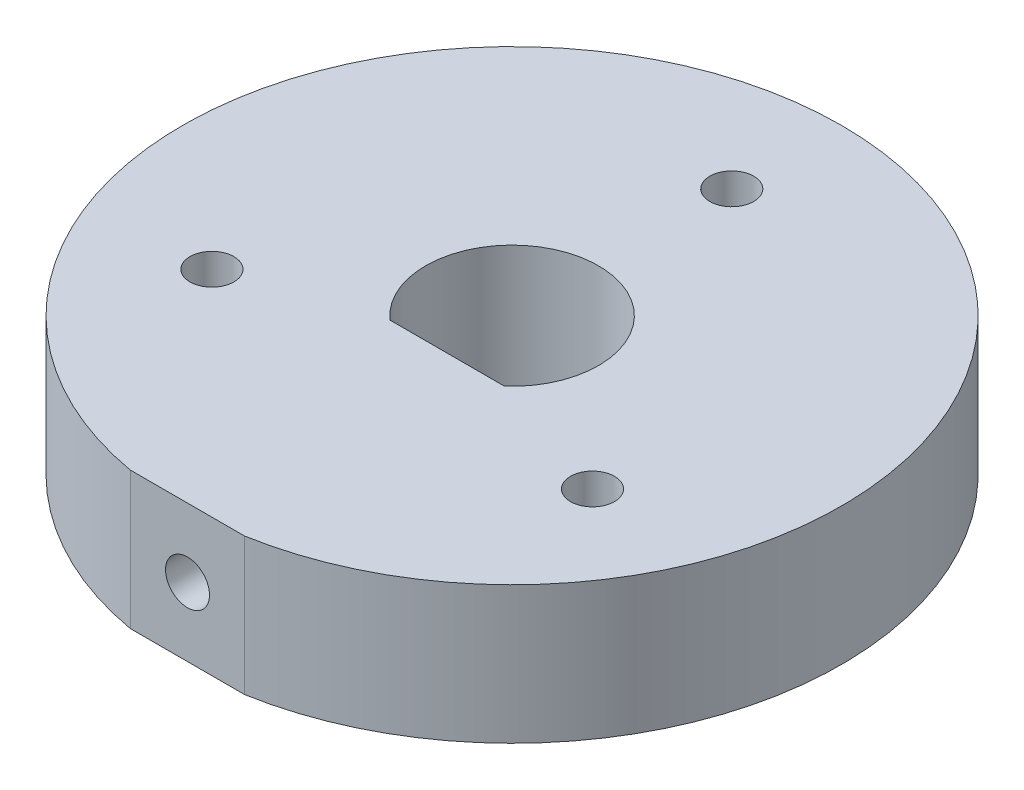
ISO-10303-21;
HEADER;
FILE_DESCRIPTION(('STEP AP214'),'2;1');
FILE_NAME('part.step','',(''),(''),'','','');
FILE_SCHEMA(('AUTOMOTIVE_DESIGN { 1 0 10303 214 1 1 1 1 }'));
ENDSEC;
DATA;
#1=APPLICATION_CONTEXT('core data for automotive mechanical design processes');
#2=APPLICATION_PROTOCOL_DEFINITION('international standard','automotive_design',2000,#1);
#3=PRODUCT_CONTEXT('',#1,'mechanical');
#4=PRODUCT('Part','Part','',(#3));
#5=PRODUCT_RELATED_PRODUCT_CATEGORY('part','',(#4));
#6=PRODUCT_DEFINITION_FORMATION('','',#4);
#7=PRODUCT_DEFINITION_CONTEXT('part definition',#1,'design');
#8=PRODUCT_DEFINITION('design','',#6,#7);
#9=PRODUCT_DEFINITION_SHAPE('','',#8);
#10=(LENGTH_UNIT() NAMED_UNIT(*) SI_UNIT(.MILLI.,.METRE.));
#11=(NAMED_UNIT(*) PLANE_ANGLE_UNIT() SI_UNIT($,.RADIAN.));
#12=(NAMED_UNIT(*) SI_UNIT($,.STERADIAN.) SOLID_ANGLE_UNIT());
#13=UNCERTAINTY_MEASURE_WITH_UNIT(LENGTH_MEASURE(1.E-05),#10,'distance_accuracy_value','');
#14=(GEOMETRIC_REPRESENTATION_CONTEXT(3) GLOBAL_UNCERTAINTY_ASSIGNED_CONTEXT((#13)) GLOBAL_UNIT_ASSIGNED_CONTEXT((#10,
#11,#12)) REPRESENTATION_CONTEXT('',''));
#15=CARTESIAN_POINT('',(0.,0.,0.));
#16=DIRECTION('',(0.,0.,1.));
#17=DIRECTION('',(1.,0.,0.));
#18=AXIS2_PLACEMENT_3D('',#15,#16,#17);
#19=CARTESIAN_POINT('',(0.,6.35,0.));
#20=DIRECTION('',(0.,-1.,0.));
#21=DIRECTION('',(0.,0.,-1.));
#22=AXIS2_PLACEMENT_3D('',#19,#20,#21);
#23=PLANE('',#22);
#24=CARTESIAN_POINT('',(8.79881810244988,6.35,5.08000000000004));
#25=DIRECTION('',(0.,1.,0.));
#26=DIRECTION('',(0.,0.,1.));
#27=AXIS2_PLACEMENT_3D('',#24,#25,#26);
#28=CIRCLE('',#27,1.016);
#29=CARTESIAN_POINT('',(8.79881810244988,6.35,6.09600000000004));
#30=VERTEX_POINT('',#29);
#31=EDGE_CURVE('E128',#30,#30,#28,.T.);
#32=ORIENTED_EDGE('',*,*,#31,.F.);
#33=EDGE_LOOP('',(#32));
#34=FACE_BOUND('',#33,.T.);
#35=CARTESIAN_POINT('',(0.,6.35,0.));
#36=DIRECTION('',(0.,1.,0.));
#37=DIRECTION('',(0.,0.,-1.));
#38=AXIS2_PLACEMENT_3D('',#35,#36,#37);
#39=CIRCLE('',#38,4.);
#40=CARTESIAN_POINT('',(2.64575131106459,6.35,3.));
#41=VERTEX_POINT('',#40);
#42=CARTESIAN_POINT('',(-2.64575131106459,6.35,3.));
#43=VERTEX_POINT('',#42);
#44=EDGE_CURVE('E78',#41,#43,#39,.T.);
#45=ORIENTED_EDGE('',*,*,#44,.F.);
#46=DIRECTION('',(1.,0.,0.));
#47=VECTOR('',#46,1.);
#48=CARTESIAN_POINT('',(-2.64575131106459,6.35,3.));
#49=LINE('',#48,#47);
#50=EDGE_CURVE('E72',#43,#41,#49,.T.);
#51=ORIENTED_EDGE('',*,*,#50,.F.);
#52=EDGE_LOOP('',(#45,#51));
#53=FACE_BOUND('',#52,.T.);
#54=CARTESIAN_POINT('',(0.,6.35,0.));
#55=DIRECTION('',(0.,1.,0.));
#56=DIRECTION('',(0.,0.,-1.));
#57=AXIS2_PLACEMENT_3D('',#54,#55,#56);
#58=CIRCLE('',#57,15.24);
#59=CARTESIAN_POINT('',(2.64575131106459,6.35,15.0085842103777));
#60=VERTEX_POINT('',#59);
#61=CARTESIAN_POINT('',(-2.64575131106459,6.35,15.0085842103777));
#62=VERTEX_POINT('',#61);
#63=EDGE_CURVE('E94',#60,#62,#58,.T.);
#64=ORIENTED_EDGE('',*,*,#63,.T.);
#65=DIRECTION('',(1.,0.,0.));
#66=VECTOR('',#65,1.);
#67=CARTESIAN_POINT('',(-2.64575131106459,6.35,15.0085842103777));
#68=LINE('',#67,#66);
#69=EDGE_CURVE('E97',#62,#60,#68,.T.);
#70=ORIENTED_EDGE('',*,*,#69,.T.);
#71=EDGE_LOOP('',(#64,#70));
#72=FACE_BOUND('',#71,.T.);
#73=CARTESIAN_POINT('',(0.,6.35,-10.16));
#74=DIRECTION('',(0.,1.,0.));
#75=DIRECTION('',(0.,0.,1.));
#76=AXIS2_PLACEMENT_3D('',#73,#74,#75);
#77=CIRCLE('',#76,1.016);
#78=CARTESIAN_POINT('',(0.,6.35,-9.144));
#79=VERTEX_POINT('',#78);
#80=EDGE_CURVE('E90',#79,#79,#77,.T.);
#81=ORIENTED_EDGE('',*,*,#80,.F.);
#82=EDGE_LOOP('',(#81));
#83=FACE_BOUND('',#82,.T.);
#84=CARTESIAN_POINT('',(-8.79881810244994,6.35,5.07999999999992));
#85=DIRECTION('',(0.,1.,0.));
#86=DIRECTION('',(0.,0.,1.));
#87=AXIS2_PLACEMENT_3D('',#84,#85,#86);
#88=CIRCLE('',#87,1.016);
#89=CARTESIAN_POINT('',(-8.79881810244994,6.35,6.09599999999992));
#90=VERTEX_POINT('',#89);
#91=EDGE_CURVE('E122',#90,#90,#88,.T.);
#92=ORIENTED_EDGE('',*,*,#91,.F.);
#93=EDGE_LOOP('',(#92));
#94=FACE_BOUND('',#93,.T.);
#95=ADVANCED_FACE('F32',(#34,#53,#72,#83,#94),#23,.F.);
#96=CARTESIAN_POINT('',(0.,0.,0.));
#97=DIRECTION('',(0.,-1.,0.));
#98=DIRECTION('',(0.,0.,-1.));
#99=AXIS2_PLACEMENT_3D('',#96,#97,#98);
#100=PLANE('',#99);
#101=CARTESIAN_POINT('',(8.79881810244988,0.,5.08000000000004));
#102=DIRECTION('',(0.,1.,0.));
#103=DIRECTION('',(0.,0.,1.));
#104=AXIS2_PLACEMENT_3D('',#101,#102,#103);
#105=CIRCLE('',#104,1.016);
#106=CARTESIAN_POINT('',(8.79881810244988,0.,6.09600000000004));
#107=VERTEX_POINT('',#106);
#108=EDGE_CURVE('E124',#107,#107,#105,.T.);
#109=ORIENTED_EDGE('',*,*,#108,.T.);
#110=EDGE_LOOP('',(#109));
#111=FACE_BOUND('',#110,.T.);
#112=DIRECTION('',(1.,0.,0.));
#113=VECTOR('',#112,1.);
#114=CARTESIAN_POINT('',(-2.64575131106459,0.,3.));
#115=LINE('',#114,#113);
#116=CARTESIAN_POINT('',(-2.64575131106459,0.,3.));
#117=VERTEX_POINT('',#116);
#118=CARTESIAN_POINT('',(2.64575131106459,0.,3.));
#119=VERTEX_POINT('',#118);
#120=EDGE_CURVE('E83',#117,#119,#115,.T.);
#121=ORIENTED_EDGE('',*,*,#120,.T.);
#122=CARTESIAN_POINT('',(0.,0.,0.));
#123=DIRECTION('',(0.,1.,0.));
#124=DIRECTION('',(0.,0.,-1.));
#125=AXIS2_PLACEMENT_3D('',#122,#123,#124);
#126=CIRCLE('',#125,4.);
#127=EDGE_CURVE('E54',#119,#117,#126,.T.);
#128=ORIENTED_EDGE('',*,*,#127,.T.);
#129=EDGE_LOOP('',(#121,#128));
#130=FACE_BOUND('',#129,.T.);
#131=CARTESIAN_POINT('',(0.,0.,0.));
#132=DIRECTION('',(0.,1.,0.));
#133=DIRECTION('',(0.,0.,-1.));
#134=AXIS2_PLACEMENT_3D('',#131,#132,#133);
#135=CIRCLE('',#134,15.24);
#136=CARTESIAN_POINT('',(2.64575131106459,0.,15.0085842103777));
#137=VERTEX_POINT('',#136);
#138=CARTESIAN_POINT('',(-2.64575131106459,0.,15.0085842103777));
#139=VERTEX_POINT('',#138);
#140=EDGE_CURVE('E93',#137,#139,#135,.T.);
#141=ORIENTED_EDGE('',*,*,#140,.F.);
#142=DIRECTION('',(1.,0.,0.));
#143=VECTOR('',#142,1.);
#144=CARTESIAN_POINT('',(-2.64575131106459,0.,15.0085842103777));
#145=LINE('',#144,#143);
#146=EDGE_CURVE('E98',#139,#137,#145,.T.);
#147=ORIENTED_EDGE('',*,*,#146,.F.);
#148=EDGE_LOOP('',(#141,#147));
#149=FACE_BOUND('',#148,.T.);
#150=CARTESIAN_POINT('',(0.,0.,-10.16));
#151=DIRECTION('',(0.,1.,0.));
#152=DIRECTION('',(0.,0.,1.));
#153=AXIS2_PLACEMENT_3D('',#150,#151,#152);
#154=CIRCLE('',#153,1.016);
#155=CARTESIAN_POINT('',(0.,0.,-9.144));
#156=VERTEX_POINT('',#155);
#157=EDGE_CURVE('E87',#156,#156,#154,.T.);
#158=ORIENTED_EDGE('',*,*,#157,.T.);
#159=EDGE_LOOP('',(#158));
#160=FACE_BOUND('',#159,.T.);
#161=CARTESIAN_POINT('',(-8.79881810244994,0.,5.07999999999992));
#162=DIRECTION('',(0.,1.,0.));
#163=DIRECTION('',(0.,0.,1.));
#164=AXIS2_PLACEMENT_3D('',#161,#162,#163);
#165=CIRCLE('',#164,1.016);
#166=CARTESIAN_POINT('',(-8.79881810244994,0.,6.09599999999992));
#167=VERTEX_POINT('',#166);
#168=EDGE_CURVE('E125',#167,#167,#165,.T.);
#169=ORIENTED_EDGE('',*,*,#168,.T.);
#170=EDGE_LOOP('',(#169));
#171=FACE_BOUND('',#170,.T.);
#172=ADVANCED_FACE('F110',(#111,#130,#149,#160,#171),#100,.T.);
#173=CARTESIAN_POINT('',(0.,6.35,0.));
#174=DIRECTION('',(0.,-1.,0.));
#175=DIRECTION('',(0.,0.,-1.));
#176=AXIS2_PLACEMENT_3D('',#173,#174,#175);
#177=CYLINDRICAL_SURFACE('',#176,15.24);
#178=ORIENTED_EDGE('',*,*,#140,.T.);
#179=DIRECTION('',(0.,-1.,0.));
#180=VECTOR('',#179,1.);
#181=CARTESIAN_POINT('',(-2.64575131106459,6.35,15.0085842103777));
#182=LINE('',#181,#180);
#183=EDGE_CURVE('E11',#62,#139,#182,.T.);
#184=ORIENTED_EDGE('',*,*,#183,.F.);
#185=ORIENTED_EDGE('',*,*,#63,.F.);
#186=DIRECTION('',(0.,-1.,0.));
#187=VECTOR('',#186,1.);
#188=CARTESIAN_POINT('',(2.64575131106459,6.35,15.0085842103777));
#189=LINE('',#188,#187);
#190=EDGE_CURVE('E40',#60,#137,#189,.T.);
#191=ORIENTED_EDGE('',*,*,#190,.T.);
#192=EDGE_LOOP('',(#178,#184,#185,#191));
#193=FACE_BOUND('',#192,.T.);
#194=ADVANCED_FACE('F34',(#193),#177,.T.);
#195=CARTESIAN_POINT('',(-2.64575131106459,6.35,15.0085842103777));
#196=DIRECTION('',(0.,0.,-1.));
#197=DIRECTION('',(-1.,0.,0.));
#198=AXIS2_PLACEMENT_3D('',#195,#196,#197);
#199=PLANE('',#198);
#200=CARTESIAN_POINT('',(0.,3.175,15.0085842103777));
#201=DIRECTION('',(0.,0.,1.));
#202=DIRECTION('',(1.,0.,0.));
#203=AXIS2_PLACEMENT_3D('',#200,#201,#202);
#204=CIRCLE('',#203,1.016);
#205=CARTESIAN_POINT('',(1.016,3.175,15.0085842103777));
#206=VERTEX_POINT('',#205);
#207=EDGE_CURVE('E131',#206,#206,#204,.T.);
#208=ORIENTED_EDGE('',*,*,#207,.F.);
#209=EDGE_LOOP('',(#208));
#210=FACE_BOUND('',#209,.T.);
#211=ORIENTED_EDGE('',*,*,#146,.T.);
#212=ORIENTED_EDGE('',*,*,#190,.F.);
#213=ORIENTED_EDGE('',*,*,#69,.F.);
#214=ORIENTED_EDGE('',*,*,#183,.T.);
#215=EDGE_LOOP('',(#211,#212,#213,#214));
#216=FACE_BOUND('',#215,.T.);
#217=ADVANCED_FACE('F112',(#210,#216),#199,.F.);
#218=CARTESIAN_POINT('',(0.,6.35,0.));
#219=DIRECTION('',(0.,-1.,0.));
#220=DIRECTION('',(0.,0.,-1.));
#221=AXIS2_PLACEMENT_3D('',#218,#219,#220);
#222=CYLINDRICAL_SURFACE('',#221,4.);
#223=ORIENTED_EDGE('',*,*,#127,.F.);
#224=DIRECTION('',(0.,-1.,0.));
#225=VECTOR('',#224,1.);
#226=CARTESIAN_POINT('',(2.64575131106459,6.35,3.));
#227=LINE('',#226,#225);
#228=EDGE_CURVE('E74',#41,#119,#227,.T.);
#229=ORIENTED_EDGE('',*,*,#228,.F.);
#230=ORIENTED_EDGE('',*,*,#44,.T.);
#231=DIRECTION('',(0.,-1.,0.));
#232=VECTOR('',#231,1.);
#233=CARTESIAN_POINT('',(-2.64575131106459,6.35,3.));
#234=LINE('',#233,#232);
#235=EDGE_CURVE('E47',#43,#117,#234,.T.);
#236=ORIENTED_EDGE('',*,*,#235,.T.);
#237=EDGE_LOOP('',(#223,#229,#230,#236));
#238=FACE_BOUND('',#237,.T.);
#239=ADVANCED_FACE('F80',(#238),#222,.F.);
#240=CARTESIAN_POINT('',(-2.64575131106459,6.35,3.));
#241=DIRECTION('',(0.,0.,-1.));
#242=DIRECTION('',(-1.,0.,0.));
#243=AXIS2_PLACEMENT_3D('',#240,#241,#242);
#244=PLANE('',#243);
#245=CARTESIAN_POINT('',(0.,3.175,3.));
#246=DIRECTION('',(0.,0.,-1.));
#247=DIRECTION('',(-1.,0.,0.));
#248=AXIS2_PLACEMENT_3D('',#245,#246,#247);
#249=CIRCLE('',#248,1.016);
#250=CARTESIAN_POINT('',(-1.016,3.175,3.));
#251=VERTEX_POINT('',#250);
#252=EDGE_CURVE('E169',#251,#251,#249,.F.);
#253=ORIENTED_EDGE('',*,*,#252,.T.);
#254=EDGE_LOOP('',(#253));
#255=FACE_BOUND('',#254,.T.);
#256=ORIENTED_EDGE('',*,*,#120,.F.);
#257=ORIENTED_EDGE('',*,*,#235,.F.);
#258=ORIENTED_EDGE('',*,*,#50,.T.);
#259=ORIENTED_EDGE('',*,*,#228,.T.);
#260=EDGE_LOOP('',(#256,#257,#258,#259));
#261=FACE_BOUND('',#260,.T.);
#262=ADVANCED_FACE('F73',(#255,#261),#244,.T.);
#263=CARTESIAN_POINT('',(0.,6.35,-10.16));
#264=DIRECTION('',(0.,-1.,0.));
#265=DIRECTION('',(0.,0.,-1.));
#266=AXIS2_PLACEMENT_3D('',#263,#264,#265);
#267=CYLINDRICAL_SURFACE('',#266,1.016);
#268=ORIENTED_EDGE('',*,*,#80,.T.);
#269=EDGE_LOOP('',(#268));
#270=FACE_BOUND('',#269,.T.);
#271=ORIENTED_EDGE('',*,*,#157,.F.);
#272=EDGE_LOOP('',(#271));
#273=FACE_BOUND('',#272,.T.);
#274=ADVANCED_FACE('F142',(#270,#273),#267,.F.);
#275=CARTESIAN_POINT('',(8.79881810244988,6.35,5.08000000000004));
#276=DIRECTION('',(0.,-1.,0.));
#277=DIRECTION('',(0.,0.,-1.));
#278=AXIS2_PLACEMENT_3D('',#275,#276,#277);
#279=CYLINDRICAL_SURFACE('',#278,1.016);
#280=ORIENTED_EDGE('',*,*,#31,.T.);
#281=EDGE_LOOP('',(#280));
#282=FACE_BOUND('',#281,.T.);
#283=ORIENTED_EDGE('',*,*,#108,.F.);
#284=EDGE_LOOP('',(#283));
#285=FACE_BOUND('',#284,.T.);
#286=ADVANCED_FACE('F144',(#282,#285),#279,.F.);
#287=CARTESIAN_POINT('',(-8.79881810244994,6.35,5.07999999999992));
#288=DIRECTION('',(0.,-1.,0.));
#289=DIRECTION('',(0.,0.,-1.));
#290=AXIS2_PLACEMENT_3D('',#287,#288,#289);
#291=CYLINDRICAL_SURFACE('',#290,1.016);
#292=ORIENTED_EDGE('',*,*,#91,.T.);
#293=EDGE_LOOP('',(#292));
#294=FACE_BOUND('',#293,.T.);
#295=ORIENTED_EDGE('',*,*,#168,.F.);
#296=EDGE_LOOP('',(#295));
#297=FACE_BOUND('',#296,.T.);
#298=ADVANCED_FACE('F150',(#294,#297),#291,.F.);
#299=CARTESIAN_POINT('',(0.,3.175,-15.241));
#300=DIRECTION('',(0.,0.,1.));
#301=DIRECTION('',(1.,0.,0.));
#302=AXIS2_PLACEMENT_3D('',#299,#300,#301);
#303=CYLINDRICAL_SURFACE('',#302,1.016);
#304=ORIENTED_EDGE('',*,*,#252,.F.);
#305=EDGE_LOOP('',(#304));
#306=FACE_BOUND('',#305,.T.);
#307=ORIENTED_EDGE('',*,*,#207,.T.);
#308=EDGE_LOOP('',(#307));
#309=FACE_BOUND('',#308,.T.);
#310=ADVANCED_FACE('F173',(#306,#309),#303,.F.);
#311=CLOSED_SHELL('',(#95,#172,#194,#217,#239,#262,#274,#286,#298,#310));
#312=MANIFOLD_SOLID_BREP('B2',#311);
#313=ADVANCED_BREP_SHAPE_REPRESENTATION('',(#18,#312),#14);
#314=SHAPE_DEFINITION_REPRESENTATION(#9,#313);
ENDSEC;
END-ISO-10303-21;
